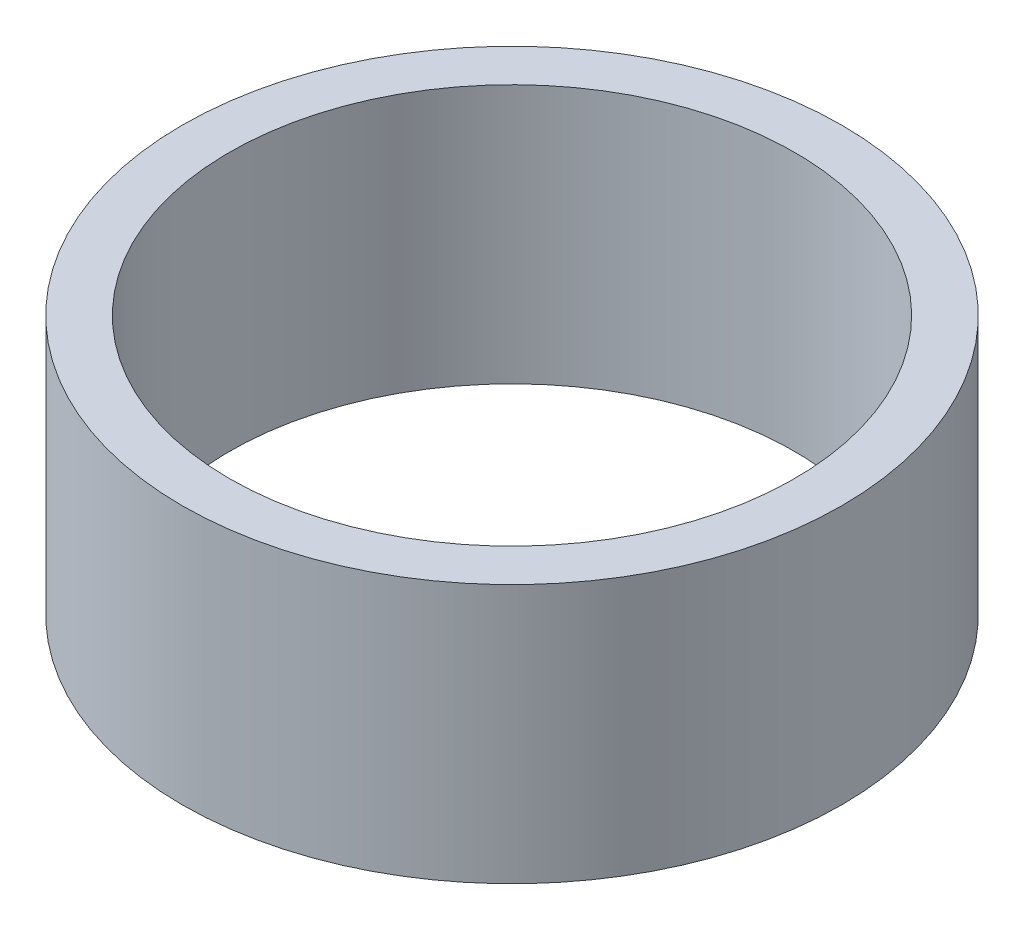
ISO-10303-21;
HEADER;
FILE_DESCRIPTION(('STEP AP214'),'2;1');
FILE_NAME('part.step','',(''),(''),'','','');
FILE_SCHEMA(('AUTOMOTIVE_DESIGN { 1 0 10303 214 1 1 1 1 }'));
ENDSEC;
DATA;
#1=APPLICATION_CONTEXT('core data for automotive mechanical design processes');
#2=APPLICATION_PROTOCOL_DEFINITION('international standard','automotive_design',2000,#1);
#3=PRODUCT_CONTEXT('',#1,'mechanical');
#4=PRODUCT('Part','Part','',(#3));
#5=PRODUCT_RELATED_PRODUCT_CATEGORY('part','',(#4));
#6=PRODUCT_DEFINITION_FORMATION('','',#4);
#7=PRODUCT_DEFINITION_CONTEXT('part definition',#1,'design');
#8=PRODUCT_DEFINITION('design','',#6,#7);
#9=PRODUCT_DEFINITION_SHAPE('','',#8);
#10=(LENGTH_UNIT() NAMED_UNIT(*) SI_UNIT(.MILLI.,.METRE.));
#11=(NAMED_UNIT(*) PLANE_ANGLE_UNIT() SI_UNIT($,.RADIAN.));
#12=(NAMED_UNIT(*) SI_UNIT($,.STERADIAN.) SOLID_ANGLE_UNIT());
#13=UNCERTAINTY_MEASURE_WITH_UNIT(LENGTH_MEASURE(1.E-05),#10,'distance_accuracy_value','');
#14=(GEOMETRIC_REPRESENTATION_CONTEXT(3) GLOBAL_UNCERTAINTY_ASSIGNED_CONTEXT((#13)) GLOBAL_UNIT_ASSIGNED_CONTEXT((#10,
#11,#12)) REPRESENTATION_CONTEXT('',''));
#15=CARTESIAN_POINT('',(0.,0.,0.));
#16=DIRECTION('',(0.,0.,1.));
#17=DIRECTION('',(1.,0.,0.));
#18=AXIS2_PLACEMENT_3D('',#15,#16,#17);
#19=CARTESIAN_POINT('',(0.,22.,0.));
#20=DIRECTION('',(0.,1.,0.));
#21=DIRECTION('',(0.,0.,1.));
#22=AXIS2_PLACEMENT_3D('',#19,#20,#21);
#23=PLANE('',#22);
#24=CARTESIAN_POINT('',(0.,22.,0.));
#25=DIRECTION('',(0.,1.,0.));
#26=DIRECTION('',(0.,0.,1.));
#27=AXIS2_PLACEMENT_3D('',#24,#25,#26);
#28=CIRCLE('',#27,28.);
#29=CARTESIAN_POINT('',(0.,22.,28.));
#30=VERTEX_POINT('',#29);
#31=EDGE_CURVE('E10',#30,#30,#28,.T.);
#32=ORIENTED_EDGE('',*,*,#31,.T.);
#33=EDGE_LOOP('',(#32));
#34=FACE_BOUND('',#33,.T.);
#35=CARTESIAN_POINT('',(0.,22.,0.));
#36=DIRECTION('',(0.,1.,0.));
#37=DIRECTION('',(0.,0.,1.));
#38=AXIS2_PLACEMENT_3D('',#35,#36,#37);
#39=CIRCLE('',#38,24.);
#40=CARTESIAN_POINT('',(0.,22.,24.));
#41=VERTEX_POINT('',#40);
#42=EDGE_CURVE('E50',#41,#41,#39,.T.);
#43=ORIENTED_EDGE('',*,*,#42,.F.);
#44=EDGE_LOOP('',(#43));
#45=FACE_BOUND('',#44,.T.);
#46=ADVANCED_FACE('F39',(#34,#45),#23,.T.);
#47=CARTESIAN_POINT('',(0.,0.,0.));
#48=DIRECTION('',(0.,1.,0.));
#49=DIRECTION('',(0.,0.,1.));
#50=AXIS2_PLACEMENT_3D('',#47,#48,#49);
#51=PLANE('',#50);
#52=CARTESIAN_POINT('',(0.,0.,0.));
#53=DIRECTION('',(0.,1.,0.));
#54=DIRECTION('',(0.,0.,1.));
#55=AXIS2_PLACEMENT_3D('',#52,#53,#54);
#56=CIRCLE('',#55,28.);
#57=CARTESIAN_POINT('',(0.,0.,28.));
#58=VERTEX_POINT('',#57);
#59=EDGE_CURVE('E43',#58,#58,#56,.T.);
#60=ORIENTED_EDGE('',*,*,#59,.F.);
#61=EDGE_LOOP('',(#60));
#62=FACE_BOUND('',#61,.T.);
#63=CARTESIAN_POINT('',(0.,0.,0.));
#64=DIRECTION('',(0.,1.,0.));
#65=DIRECTION('',(0.,0.,1.));
#66=AXIS2_PLACEMENT_3D('',#63,#64,#65);
#67=CIRCLE('',#66,24.);
#68=CARTESIAN_POINT('',(0.,0.,24.));
#69=VERTEX_POINT('',#68);
#70=EDGE_CURVE('E52',#69,#69,#67,.T.);
#71=ORIENTED_EDGE('',*,*,#70,.T.);
#72=EDGE_LOOP('',(#71));
#73=FACE_BOUND('',#72,.T.);
#74=ADVANCED_FACE('F62',(#62,#73),#51,.F.);
#75=CARTESIAN_POINT('',(0.,22.,0.));
#76=DIRECTION('',(0.,-1.,0.));
#77=DIRECTION('',(0.,0.,-1.));
#78=AXIS2_PLACEMENT_3D('',#75,#76,#77);
#79=CYLINDRICAL_SURFACE('',#78,28.);
#80=ORIENTED_EDGE('',*,*,#31,.F.);
#81=EDGE_LOOP('',(#80));
#82=FACE_BOUND('',#81,.T.);
#83=ORIENTED_EDGE('',*,*,#59,.T.);
#84=EDGE_LOOP('',(#83));
#85=FACE_BOUND('',#84,.T.);
#86=ADVANCED_FACE('F41',(#82,#85),#79,.T.);
#87=CARTESIAN_POINT('',(0.,22.,0.));
#88=DIRECTION('',(0.,-1.,0.));
#89=DIRECTION('',(0.,0.,-1.));
#90=AXIS2_PLACEMENT_3D('',#87,#88,#89);
#91=CYLINDRICAL_SURFACE('',#90,24.);
#92=ORIENTED_EDGE('',*,*,#42,.T.);
#93=EDGE_LOOP('',(#92));
#94=FACE_BOUND('',#93,.T.);
#95=ORIENTED_EDGE('',*,*,#70,.F.);
#96=EDGE_LOOP('',(#95));
#97=FACE_BOUND('',#96,.T.);
#98=ADVANCED_FACE('F58',(#94,#97),#91,.F.);
#99=CLOSED_SHELL('',(#46,#74,#86,#98));
#100=MANIFOLD_SOLID_BREP('B2',#99);
#101=ADVANCED_BREP_SHAPE_REPRESENTATION('',(#18,#100),#14);
#102=SHAPE_DEFINITION_REPRESENTATION(#9,#101);
ENDSEC;
END-ISO-10303-21;
